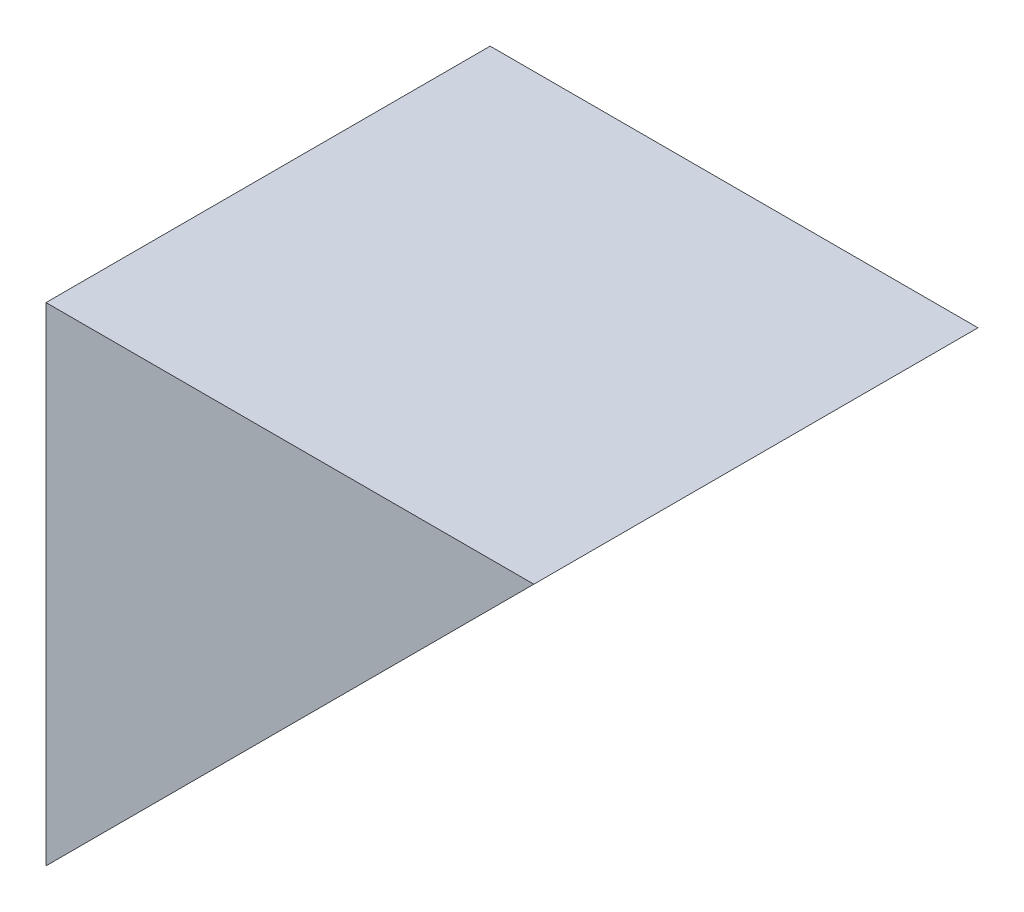
ISO-10303-21;
HEADER;
FILE_DESCRIPTION(('STEP AP214'),'2;1');
FILE_NAME('part.step','',(''),(''),'','','');
FILE_SCHEMA(('AUTOMOTIVE_DESIGN { 1 0 10303 214 1 1 1 1 }'));
ENDSEC;
DATA;
#1=APPLICATION_CONTEXT('core data for automotive mechanical design processes');
#2=APPLICATION_PROTOCOL_DEFINITION('international standard','automotive_design',2000,#1);
#3=PRODUCT_CONTEXT('',#1,'mechanical');
#4=PRODUCT('Part','Part','',(#3));
#5=PRODUCT_RELATED_PRODUCT_CATEGORY('part','',(#4));
#6=PRODUCT_DEFINITION_FORMATION('','',#4);
#7=PRODUCT_DEFINITION_CONTEXT('part definition',#1,'design');
#8=PRODUCT_DEFINITION('design','',#6,#7);
#9=PRODUCT_DEFINITION_SHAPE('','',#8);
#10=(LENGTH_UNIT() NAMED_UNIT(*) SI_UNIT(.MILLI.,.METRE.));
#11=(NAMED_UNIT(*) PLANE_ANGLE_UNIT() SI_UNIT($,.RADIAN.));
#12=(NAMED_UNIT(*) SI_UNIT($,.STERADIAN.) SOLID_ANGLE_UNIT());
#13=UNCERTAINTY_MEASURE_WITH_UNIT(LENGTH_MEASURE(1.E-05),#10,'distance_accuracy_value','');
#14=(GEOMETRIC_REPRESENTATION_CONTEXT(3) GLOBAL_UNCERTAINTY_ASSIGNED_CONTEXT((#13)) GLOBAL_UNIT_ASSIGNED_CONTEXT((#10,
#11,#12)) REPRESENTATION_CONTEXT('',''));
#15=CARTESIAN_POINT('',(0.,0.,0.));
#16=DIRECTION('',(0.,0.,1.));
#17=DIRECTION('',(1.,0.,0.));
#18=AXIS2_PLACEMENT_3D('',#15,#16,#17);
#19=CARTESIAN_POINT('',(0.,0.,172.974));
#20=DIRECTION('',(1.,0.,0.));
#21=DIRECTION('',(0.,0.,-1.));
#22=AXIS2_PLACEMENT_3D('',#19,#20,#21);
#23=PLANE('',#22);
#24=DIRECTION('',(0.,-1.,0.));
#25=VECTOR('',#24,1.);
#26=CARTESIAN_POINT('',(0.,0.,0.));
#27=LINE('',#26,#25);
#28=CARTESIAN_POINT('',(0.,189.992,0.));
#29=VERTEX_POINT('',#28);
#30=CARTESIAN_POINT('',(0.,0.,0.));
#31=VERTEX_POINT('',#30);
#32=EDGE_CURVE('E97',#29,#31,#27,.T.);
#33=ORIENTED_EDGE('',*,*,#32,.T.);
#34=DIRECTION('',(0.,0.,-1.));
#35=VECTOR('',#34,1.);
#36=CARTESIAN_POINT('',(0.,0.,172.974));
#37=LINE('',#36,#35);
#38=CARTESIAN_POINT('',(0.,0.,172.974));
#39=VERTEX_POINT('',#38);
#40=EDGE_CURVE('E11',#39,#31,#37,.T.);
#41=ORIENTED_EDGE('',*,*,#40,.F.);
#42=DIRECTION('',(0.,-1.,0.));
#43=VECTOR('',#42,1.);
#44=CARTESIAN_POINT('',(0.,0.,172.974));
#45=LINE('',#44,#43);
#46=CARTESIAN_POINT('',(0.,189.992,172.974));
#47=VERTEX_POINT('',#46);
#48=EDGE_CURVE('E89',#47,#39,#45,.T.);
#49=ORIENTED_EDGE('',*,*,#48,.F.);
#50=DIRECTION('',(0.,0.,-1.));
#51=VECTOR('',#50,1.);
#52=CARTESIAN_POINT('',(0.,189.992,172.974));
#53=LINE('',#52,#51);
#54=EDGE_CURVE('E98',#47,#29,#53,.T.);
#55=ORIENTED_EDGE('',*,*,#54,.T.);
#56=EDGE_LOOP('',(#33,#41,#49,#55));
#57=FACE_BOUND('',#56,.T.);
#58=ADVANCED_FACE('F47',(#57),#23,.F.);
#59=CARTESIAN_POINT('',(0.,0.,172.974));
#60=DIRECTION('',(-0.707106781186547,0.707106781186547,0.));
#61=DIRECTION('',(-0.707106781186548,-0.707106781186548,0.));
#62=AXIS2_PLACEMENT_3D('',#59,#60,#61);
#63=PLANE('',#62);
#64=DIRECTION('',(0.707106781186548,0.707106781186548,0.));
#65=VECTOR('',#64,1.);
#66=CARTESIAN_POINT('',(0.,0.,0.));
#67=LINE('',#66,#65);
#68=CARTESIAN_POINT('',(189.992,189.992,0.));
#69=VERTEX_POINT('',#68);
#70=EDGE_CURVE('E76',#31,#69,#67,.T.);
#71=ORIENTED_EDGE('',*,*,#70,.T.);
#72=DIRECTION('',(0.,0.,-1.));
#73=VECTOR('',#72,1.);
#74=CARTESIAN_POINT('',(189.992,189.992,172.974));
#75=LINE('',#74,#73);
#76=CARTESIAN_POINT('',(189.992,189.992,172.974));
#77=VERTEX_POINT('',#76);
#78=EDGE_CURVE('E56',#77,#69,#75,.T.);
#79=ORIENTED_EDGE('',*,*,#78,.F.);
#80=DIRECTION('',(0.707106781186548,0.707106781186548,0.));
#81=VECTOR('',#80,1.);
#82=CARTESIAN_POINT('',(0.,0.,172.974));
#83=LINE('',#82,#81);
#84=EDGE_CURVE('E84',#39,#77,#83,.T.);
#85=ORIENTED_EDGE('',*,*,#84,.F.);
#86=ORIENTED_EDGE('',*,*,#40,.T.);
#87=EDGE_LOOP('',(#71,#79,#85,#86));
#88=FACE_BOUND('',#87,.T.);
#89=ADVANCED_FACE('F85',(#88),#63,.F.);
#90=CARTESIAN_POINT('',(0.,189.992,172.974));
#91=DIRECTION('',(0.,-1.,0.));
#92=DIRECTION('',(0.,0.,-1.));
#93=AXIS2_PLACEMENT_3D('',#90,#91,#92);
#94=PLANE('',#93);
#95=DIRECTION('',(-1.,0.,0.));
#96=VECTOR('',#95,1.);
#97=CARTESIAN_POINT('',(0.,189.992,0.));
#98=LINE('',#97,#96);
#99=EDGE_CURVE('E81',#69,#29,#98,.T.);
#100=ORIENTED_EDGE('',*,*,#99,.T.);
#101=ORIENTED_EDGE('',*,*,#54,.F.);
#102=DIRECTION('',(-1.,0.,0.));
#103=VECTOR('',#102,1.);
#104=CARTESIAN_POINT('',(0.,189.992,172.974));
#105=LINE('',#104,#103);
#106=EDGE_CURVE('E64',#77,#47,#105,.T.);
#107=ORIENTED_EDGE('',*,*,#106,.F.);
#108=ORIENTED_EDGE('',*,*,#78,.T.);
#109=EDGE_LOOP('',(#100,#101,#107,#108));
#110=FACE_BOUND('',#109,.T.);
#111=ADVANCED_FACE('F110',(#110),#94,.F.);
#112=CARTESIAN_POINT('',(0.,0.,172.974));
#113=DIRECTION('',(0.,0.,-1.));
#114=DIRECTION('',(-1.,0.,0.));
#115=AXIS2_PLACEMENT_3D('',#112,#113,#114);
#116=PLANE('',#115);
#117=ORIENTED_EDGE('',*,*,#48,.T.);
#118=ORIENTED_EDGE('',*,*,#84,.T.);
#119=ORIENTED_EDGE('',*,*,#106,.T.);
#120=EDGE_LOOP('',(#117,#118,#119));
#121=FACE_BOUND('',#120,.T.);
#122=ADVANCED_FACE('F92',(#121),#116,.F.);
#123=CARTESIAN_POINT('',(0.,0.,0.));
#124=DIRECTION('',(0.,0.,-1.));
#125=DIRECTION('',(-1.,0.,0.));
#126=AXIS2_PLACEMENT_3D('',#123,#124,#125);
#127=PLANE('',#126);
#128=ORIENTED_EDGE('',*,*,#32,.F.);
#129=ORIENTED_EDGE('',*,*,#99,.F.);
#130=ORIENTED_EDGE('',*,*,#70,.F.);
#131=EDGE_LOOP('',(#128,#129,#130));
#132=FACE_BOUND('',#131,.T.);
#133=ADVANCED_FACE('F111',(#132),#127,.T.);
#134=CLOSED_SHELL('',(#58,#89,#111,#122,#133));
#135=MANIFOLD_SOLID_BREP('B2',#134);
#136=ADVANCED_BREP_SHAPE_REPRESENTATION('',(#18,#135),#14);
#137=SHAPE_DEFINITION_REPRESENTATION(#9,#136);
ENDSEC;
END-ISO-10303-21;
